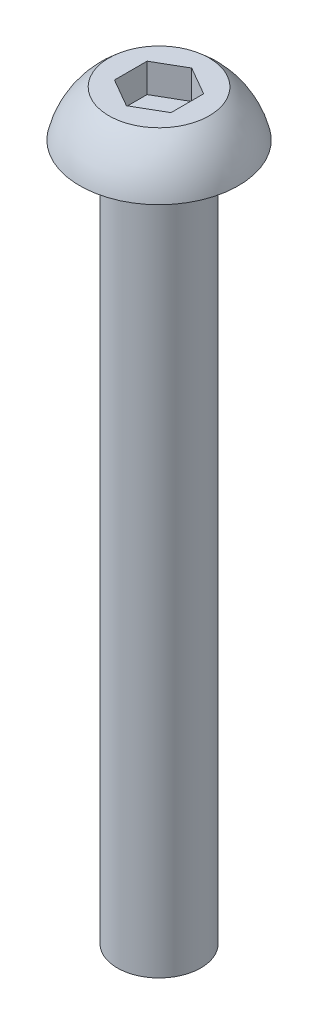
ISO-10303-21;
HEADER;
FILE_DESCRIPTION(('STEP AP214'),'2;1');
FILE_NAME('part.step','',(''),(''),'','','');
FILE_SCHEMA(('AUTOMOTIVE_DESIGN { 1 0 10303 214 1 1 1 1 }'));
ENDSEC;
DATA;
#1=APPLICATION_CONTEXT('core data for automotive mechanical design processes');
#2=APPLICATION_PROTOCOL_DEFINITION('international standard','automotive_design',2000,#1);
#3=PRODUCT_CONTEXT('',#1,'mechanical');
#4=PRODUCT('Part','Part','',(#3));
#5=PRODUCT_RELATED_PRODUCT_CATEGORY('part','',(#4));
#6=PRODUCT_DEFINITION_FORMATION('','',#4);
#7=PRODUCT_DEFINITION_CONTEXT('part definition',#1,'design');
#8=PRODUCT_DEFINITION('design','',#6,#7);
#9=PRODUCT_DEFINITION_SHAPE('','',#8);
#10=(LENGTH_UNIT() NAMED_UNIT(*) SI_UNIT(.MILLI.,.METRE.));
#11=(NAMED_UNIT(*) PLANE_ANGLE_UNIT() SI_UNIT($,.RADIAN.));
#12=(NAMED_UNIT(*) SI_UNIT($,.STERADIAN.) SOLID_ANGLE_UNIT());
#13=UNCERTAINTY_MEASURE_WITH_UNIT(LENGTH_MEASURE(1.E-05),#10,'distance_accuracy_value','');
#14=(GEOMETRIC_REPRESENTATION_CONTEXT(3) GLOBAL_UNCERTAINTY_ASSIGNED_CONTEXT((#13)) GLOBAL_UNIT_ASSIGNED_CONTEXT((#10,
#11,#12)) REPRESENTATION_CONTEXT('',''));
#15=CARTESIAN_POINT('',(0.,0.,0.));
#16=DIRECTION('',(0.,0.,1.));
#17=DIRECTION('',(1.,0.,0.));
#18=AXIS2_PLACEMENT_3D('',#15,#16,#17);
#19=CARTESIAN_POINT('',(0.,0.,0.));
#20=DIRECTION('',(0.,-1.,0.));
#21=DIRECTION('',(-1.,0.,0.));
#22=AXIS2_PLACEMENT_3D('',#19,#20,#21);
#23=SPHERICAL_SURFACE('',#22,2.92419728336959);
#24=CARTESIAN_POINT('',(0.,0.654545454545435,0.));
#25=DIRECTION('',(0.,-1.,0.));
#26=DIRECTION('',(0.,0.,-1.));
#27=AXIS2_PLACEMENT_3D('',#24,#25,#26);
#28=CIRCLE('',#27,2.85);
#29=CARTESIAN_POINT('',(0.,0.654545454545435,-2.85));
#30=VERTEX_POINT('',#29);
#31=EDGE_CURVE('E149',#30,#30,#28,.T.);
#32=ORIENTED_EDGE('',*,*,#31,.F.);
#33=EDGE_LOOP('',(#32));
#34=FACE_BOUND('',#33,.T.);
#35=CARTESIAN_POINT('',(0.,2.30454545454545,0.));
#36=DIRECTION('',(0.,-1.,0.));
#37=DIRECTION('',(0.,0.,-1.));
#38=AXIS2_PLACEMENT_3D('',#35,#36,#37);
#39=CIRCLE('',#38,1.8);
#40=CARTESIAN_POINT('',(0.,2.30454545454545,-1.8));
#41=VERTEX_POINT('',#40);
#42=EDGE_CURVE('E138',#41,#41,#39,.T.);
#43=ORIENTED_EDGE('',*,*,#42,.T.);
#44=EDGE_LOOP('',(#43));
#45=FACE_BOUND('',#44,.T.);
#46=ADVANCED_FACE('F36',(#34,#45),#23,.T.);
#47=CARTESIAN_POINT('',(-2.85,0.654545454545435,0.));
#48=DIRECTION('',(0.,1.,0.));
#49=DIRECTION('',(0.,0.,1.));
#50=AXIS2_PLACEMENT_3D('',#47,#48,#49);
#51=PLANE('',#50);
#52=CARTESIAN_POINT('',(0.,0.654545454545435,0.));
#53=DIRECTION('',(0.,1.,0.));
#54=DIRECTION('',(0.,0.,1.));
#55=AXIS2_PLACEMENT_3D('',#52,#53,#54);
#56=CIRCLE('',#55,1.6);
#57=CARTESIAN_POINT('',(0.,0.654545454545435,1.6));
#58=VERTEX_POINT('',#57);
#59=EDGE_CURVE('E11',#58,#58,#56,.T.);
#60=ORIENTED_EDGE('',*,*,#59,.T.);
#61=EDGE_LOOP('',(#60));
#62=FACE_BOUND('',#61,.T.);
#63=ORIENTED_EDGE('',*,*,#31,.T.);
#64=EDGE_LOOP('',(#63));
#65=FACE_BOUND('',#64,.T.);
#66=ADVANCED_FACE('F166',(#62,#65),#51,.F.);
#67=CARTESIAN_POINT('',(0.,0.,0.));
#68=DIRECTION('',(0.,-1.,0.));
#69=DIRECTION('',(0.,0.,-1.));
#70=AXIS2_PLACEMENT_3D('',#67,#68,#69);
#71=CYLINDRICAL_SURFACE('',#70,1.5);
#72=CARTESIAN_POINT('',(0.,0.554545454545435,0.));
#73=DIRECTION('',(0.,1.,0.));
#74=DIRECTION('',(0.,0.,1.));
#75=AXIS2_PLACEMENT_3D('',#72,#73,#74);
#76=CIRCLE('',#75,1.5);
#77=CARTESIAN_POINT('',(0.,0.554545454545435,1.5));
#78=VERTEX_POINT('',#77);
#79=EDGE_CURVE('E44',#78,#78,#76,.F.);
#80=ORIENTED_EDGE('',*,*,#79,.T.);
#81=EDGE_LOOP('',(#80));
#82=FACE_BOUND('',#81,.T.);
#83=CARTESIAN_POINT('',(0.,-24.3454545454546,0.));
#84=DIRECTION('',(0.,-1.,0.));
#85=DIRECTION('',(0.,0.,-1.));
#86=AXIS2_PLACEMENT_3D('',#83,#84,#85);
#87=CIRCLE('',#86,1.5);
#88=CARTESIAN_POINT('',(0.,-24.3454545454546,-1.5));
#89=VERTEX_POINT('',#88);
#90=EDGE_CURVE('E146',#89,#89,#87,.T.);
#91=ORIENTED_EDGE('',*,*,#90,.F.);
#92=EDGE_LOOP('',(#91));
#93=FACE_BOUND('',#92,.T.);
#94=ADVANCED_FACE('F154',(#82,#93),#71,.T.);
#95=CARTESIAN_POINT('',(0.,-24.3454545454546,0.));
#96=DIRECTION('',(0.,1.,0.));
#97=DIRECTION('',(0.,0.,1.));
#98=AXIS2_PLACEMENT_3D('',#95,#96,#97);
#99=PLANE('',#98);
#100=ORIENTED_EDGE('',*,*,#90,.T.);
#101=EDGE_LOOP('',(#100));
#102=FACE_BOUND('',#101,.T.);
#103=ADVANCED_FACE('F178',(#102),#99,.F.);
#104=CARTESIAN_POINT('',(0.,2.30454545454545,0.));
#105=DIRECTION('',(0.,-1.,0.));
#106=DIRECTION('',(0.,0.,-1.));
#107=AXIS2_PLACEMENT_3D('',#104,#105,#106);
#108=PLANE('',#107);
#109=DIRECTION('',(0.866025403784439,0.,-0.499999999999999));
#110=VECTOR('',#109,1.);
#111=CARTESIAN_POINT('',(0.,2.30454545454545,1.17202104645494));
#112=LINE('',#111,#110);
#113=CARTESIAN_POINT('',(0.,2.30454545454545,1.17202104645494));
#114=VERTEX_POINT('',#113);
#115=CARTESIAN_POINT('',(1.015,2.30454545454545,0.58601052322747));
#116=VERTEX_POINT('',#115);
#117=EDGE_CURVE('E125',#114,#116,#112,.T.);
#118=ORIENTED_EDGE('',*,*,#117,.F.);
#119=DIRECTION('',(0.866025403784439,0.,0.5));
#120=VECTOR('',#119,1.);
#121=CARTESIAN_POINT('',(-1.015,2.30454545454545,0.58601052322747));
#122=LINE('',#121,#120);
#123=CARTESIAN_POINT('',(-1.015,2.30454545454545,0.58601052322747));
#124=VERTEX_POINT('',#123);
#125=EDGE_CURVE('E51',#124,#114,#122,.T.);
#126=ORIENTED_EDGE('',*,*,#125,.F.);
#127=DIRECTION('',(0.,0.,1.));
#128=VECTOR('',#127,1.);
#129=CARTESIAN_POINT('',(-1.015,2.30454545454545,-0.586010523227472));
#130=LINE('',#129,#128);
#131=CARTESIAN_POINT('',(-1.015,2.30454545454545,-0.586010523227472));
#132=VERTEX_POINT('',#131);
#133=EDGE_CURVE('E134',#132,#124,#130,.T.);
#134=ORIENTED_EDGE('',*,*,#133,.F.);
#135=DIRECTION('',(-0.866025403784439,0.,0.499999999999999));
#136=VECTOR('',#135,1.);
#137=CARTESIAN_POINT('',(0.,2.30454545454545,-1.17202104645494));
#138=LINE('',#137,#136);
#139=CARTESIAN_POINT('',(0.,2.30454545454545,-1.17202104645494));
#140=VERTEX_POINT('',#139);
#141=EDGE_CURVE('E132',#140,#132,#138,.T.);
#142=ORIENTED_EDGE('',*,*,#141,.F.);
#143=DIRECTION('',(-0.866025403784439,0.,-0.5));
#144=VECTOR('',#143,1.);
#145=CARTESIAN_POINT('',(1.015,2.30454545454545,-0.586010523227475));
#146=LINE('',#145,#144);
#147=CARTESIAN_POINT('',(1.015,2.30454545454545,-0.586010523227475));
#148=VERTEX_POINT('',#147);
#149=EDGE_CURVE('E99',#148,#140,#146,.T.);
#150=ORIENTED_EDGE('',*,*,#149,.F.);
#151=DIRECTION('',(0.,0.,-1.));
#152=VECTOR('',#151,1.);
#153=CARTESIAN_POINT('',(1.015,2.30454545454545,0.58601052322747));
#154=LINE('',#153,#152);
#155=EDGE_CURVE('E128',#116,#148,#154,.T.);
#156=ORIENTED_EDGE('',*,*,#155,.F.);
#157=EDGE_LOOP('',(#118,#126,#134,#142,#150,#156));
#158=FACE_BOUND('',#157,.T.);
#159=ORIENTED_EDGE('',*,*,#42,.F.);
#160=EDGE_LOOP('',(#159));
#161=FACE_BOUND('',#160,.T.);
#162=ADVANCED_FACE('F181',(#158,#161),#108,.F.);
#163=CARTESIAN_POINT('',(-1.015,1.26454545454545,0.58601052322747));
#164=DIRECTION('',(-0.5,0.,0.866025403784439));
#165=DIRECTION('',(0.866025403784439,0.,0.5));
#166=AXIS2_PLACEMENT_3D('',#163,#164,#165);
#167=PLANE('',#166);
#168=ORIENTED_EDGE('',*,*,#125,.T.);
#169=DIRECTION('',(0.,1.,0.));
#170=VECTOR('',#169,1.);
#171=CARTESIAN_POINT('',(0.,1.26454545454545,1.17202104645494));
#172=LINE('',#171,#170);
#173=CARTESIAN_POINT('',(0.,1.26454545454545,1.17202104645494));
#174=VERTEX_POINT('',#173);
#175=EDGE_CURVE('E81',#174,#114,#172,.T.);
#176=ORIENTED_EDGE('',*,*,#175,.F.);
#177=DIRECTION('',(0.866025403784439,0.,0.5));
#178=VECTOR('',#177,1.);
#179=CARTESIAN_POINT('',(-1.015,1.26454545454545,0.58601052322747));
#180=LINE('',#179,#178);
#181=CARTESIAN_POINT('',(-1.015,1.26454545454545,0.58601052322747));
#182=VERTEX_POINT('',#181);
#183=EDGE_CURVE('E136',#182,#174,#180,.T.);
#184=ORIENTED_EDGE('',*,*,#183,.F.);
#185=DIRECTION('',(0.,1.,0.));
#186=VECTOR('',#185,1.);
#187=CARTESIAN_POINT('',(-1.015,1.26454545454545,0.58601052322747));
#188=LINE('',#187,#186);
#189=EDGE_CURVE('E59',#182,#124,#188,.T.);
#190=ORIENTED_EDGE('',*,*,#189,.T.);
#191=EDGE_LOOP('',(#168,#176,#184,#190));
#192=FACE_BOUND('',#191,.T.);
#193=ADVANCED_FACE('F185',(#192),#167,.F.);
#194=CARTESIAN_POINT('',(-1.015,1.26454545454545,-0.586010523227472));
#195=DIRECTION('',(-1.,0.,0.));
#196=DIRECTION('',(0.,0.,1.));
#197=AXIS2_PLACEMENT_3D('',#194,#195,#196);
#198=PLANE('',#197);
#199=ORIENTED_EDGE('',*,*,#133,.T.);
#200=ORIENTED_EDGE('',*,*,#189,.F.);
#201=DIRECTION('',(0.,0.,1.));
#202=VECTOR('',#201,1.);
#203=CARTESIAN_POINT('',(-1.015,1.26454545454545,-0.586010523227472));
#204=LINE('',#203,#202);
#205=CARTESIAN_POINT('',(-1.015,1.26454545454545,-0.586010523227472));
#206=VERTEX_POINT('',#205);
#207=EDGE_CURVE('E111',#206,#182,#204,.T.);
#208=ORIENTED_EDGE('',*,*,#207,.F.);
#209=DIRECTION('',(0.,1.,0.));
#210=VECTOR('',#209,1.);
#211=CARTESIAN_POINT('',(-1.015,1.26454545454545,-0.586010523227472));
#212=LINE('',#211,#210);
#213=EDGE_CURVE('E103',#206,#132,#212,.T.);
#214=ORIENTED_EDGE('',*,*,#213,.T.);
#215=EDGE_LOOP('',(#199,#200,#208,#214));
#216=FACE_BOUND('',#215,.T.);
#217=ADVANCED_FACE('F189',(#216),#198,.F.);
#218=CARTESIAN_POINT('',(0.,1.26454545454545,-1.17202104645494));
#219=DIRECTION('',(-0.499999999999999,0.,-0.866025403784439));
#220=DIRECTION('',(-0.866025403784439,0.,0.5));
#221=AXIS2_PLACEMENT_3D('',#218,#219,#220);
#222=PLANE('',#221);
#223=ORIENTED_EDGE('',*,*,#141,.T.);
#224=ORIENTED_EDGE('',*,*,#213,.F.);
#225=DIRECTION('',(-0.866025403784439,0.,0.499999999999999));
#226=VECTOR('',#225,1.);
#227=CARTESIAN_POINT('',(0.,1.26454545454545,-1.17202104645494));
#228=LINE('',#227,#226);
#229=CARTESIAN_POINT('',(0.,1.26454545454545,-1.17202104645494));
#230=VERTEX_POINT('',#229);
#231=EDGE_CURVE('E107',#230,#206,#228,.T.);
#232=ORIENTED_EDGE('',*,*,#231,.F.);
#233=DIRECTION('',(0.,1.,0.));
#234=VECTOR('',#233,1.);
#235=CARTESIAN_POINT('',(0.,1.26454545454545,-1.17202104645494));
#236=LINE('',#235,#234);
#237=EDGE_CURVE('E92',#230,#140,#236,.T.);
#238=ORIENTED_EDGE('',*,*,#237,.T.);
#239=EDGE_LOOP('',(#223,#224,#232,#238));
#240=FACE_BOUND('',#239,.T.);
#241=ADVANCED_FACE('F108',(#240),#222,.F.);
#242=CARTESIAN_POINT('',(1.015,1.26454545454545,-0.586010523227475));
#243=DIRECTION('',(0.5,0.,-0.866025403784439));
#244=DIRECTION('',(-0.866025403784439,0.,-0.5));
#245=AXIS2_PLACEMENT_3D('',#242,#243,#244);
#246=PLANE('',#245);
#247=ORIENTED_EDGE('',*,*,#149,.T.);
#248=ORIENTED_EDGE('',*,*,#237,.F.);
#249=DIRECTION('',(-0.866025403784439,0.,-0.5));
#250=VECTOR('',#249,1.);
#251=CARTESIAN_POINT('',(1.015,1.26454545454545,-0.586010523227475));
#252=LINE('',#251,#250);
#253=CARTESIAN_POINT('',(1.015,1.26454545454545,-0.586010523227475));
#254=VERTEX_POINT('',#253);
#255=EDGE_CURVE('E96',#254,#230,#252,.T.);
#256=ORIENTED_EDGE('',*,*,#255,.F.);
#257=DIRECTION('',(0.,1.,0.));
#258=VECTOR('',#257,1.);
#259=CARTESIAN_POINT('',(1.015,1.26454545454545,-0.586010523227475));
#260=LINE('',#259,#258);
#261=EDGE_CURVE('E104',#254,#148,#260,.T.);
#262=ORIENTED_EDGE('',*,*,#261,.T.);
#263=EDGE_LOOP('',(#247,#248,#256,#262));
#264=FACE_BOUND('',#263,.T.);
#265=ADVANCED_FACE('F94',(#264),#246,.F.);
#266=CARTESIAN_POINT('',(1.015,1.26454545454545,0.58601052322747));
#267=DIRECTION('',(1.,0.,0.));
#268=DIRECTION('',(0.,0.,-1.));
#269=AXIS2_PLACEMENT_3D('',#266,#267,#268);
#270=PLANE('',#269);
#271=ORIENTED_EDGE('',*,*,#155,.T.);
#272=ORIENTED_EDGE('',*,*,#261,.F.);
#273=DIRECTION('',(0.,0.,-1.));
#274=VECTOR('',#273,1.);
#275=CARTESIAN_POINT('',(1.015,1.26454545454545,0.58601052322747));
#276=LINE('',#275,#274);
#277=CARTESIAN_POINT('',(1.015,1.26454545454545,0.58601052322747));
#278=VERTEX_POINT('',#277);
#279=EDGE_CURVE('E117',#278,#254,#276,.T.);
#280=ORIENTED_EDGE('',*,*,#279,.F.);
#281=DIRECTION('',(0.,1.,0.));
#282=VECTOR('',#281,1.);
#283=CARTESIAN_POINT('',(1.015,1.26454545454545,0.58601052322747));
#284=LINE('',#283,#282);
#285=EDGE_CURVE('E141',#278,#116,#284,.T.);
#286=ORIENTED_EDGE('',*,*,#285,.T.);
#287=EDGE_LOOP('',(#271,#272,#280,#286));
#288=FACE_BOUND('',#287,.T.);
#289=ADVANCED_FACE('F192',(#288),#270,.F.);
#290=CARTESIAN_POINT('',(0.,1.26454545454545,1.17202104645494));
#291=DIRECTION('',(0.499999999999999,0.,0.866025403784439));
#292=DIRECTION('',(0.866025403784439,0.,-0.5));
#293=AXIS2_PLACEMENT_3D('',#290,#291,#292);
#294=PLANE('',#293);
#295=ORIENTED_EDGE('',*,*,#117,.T.);
#296=ORIENTED_EDGE('',*,*,#285,.F.);
#297=DIRECTION('',(0.866025403784439,0.,-0.499999999999999));
#298=VECTOR('',#297,1.);
#299=CARTESIAN_POINT('',(0.,1.26454545454545,1.17202104645494));
#300=LINE('',#299,#298);
#301=EDGE_CURVE('E119',#174,#278,#300,.T.);
#302=ORIENTED_EDGE('',*,*,#301,.F.);
#303=ORIENTED_EDGE('',*,*,#175,.T.);
#304=EDGE_LOOP('',(#295,#296,#302,#303));
#305=FACE_BOUND('',#304,.T.);
#306=ADVANCED_FACE('F162',(#305),#294,.F.);
#307=CARTESIAN_POINT('',(0.,1.26454545454545,0.));
#308=DIRECTION('',(0.,1.,0.));
#309=DIRECTION('',(0.,0.,1.));
#310=AXIS2_PLACEMENT_3D('',#307,#308,#309);
#311=PLANE('',#310);
#312=ORIENTED_EDGE('',*,*,#183,.T.);
#313=ORIENTED_EDGE('',*,*,#301,.T.);
#314=ORIENTED_EDGE('',*,*,#279,.T.);
#315=ORIENTED_EDGE('',*,*,#255,.T.);
#316=ORIENTED_EDGE('',*,*,#231,.T.);
#317=ORIENTED_EDGE('',*,*,#207,.T.);
#318=EDGE_LOOP('',(#312,#313,#314,#315,#316,#317));
#319=FACE_BOUND('',#318,.T.);
#320=ADVANCED_FACE('F114',(#319),#311,.T.);
#321=CARTESIAN_POINT('',(0.,0.554545454545435,0.));
#322=DIRECTION('',(0.,1.,0.));
#323=DIRECTION('',(0.,0.,1.));
#324=AXIS2_PLACEMENT_3D('',#321,#322,#323);
#325=TOROIDAL_SURFACE('',#324,1.6,0.1);
#326=ORIENTED_EDGE('',*,*,#59,.F.);
#327=EDGE_LOOP('',(#326));
#328=FACE_BOUND('',#327,.T.);
#329=ORIENTED_EDGE('',*,*,#79,.F.);
#330=EDGE_LOOP('',(#329));
#331=FACE_BOUND('',#330,.T.);
#332=ADVANCED_FACE('F38',(#328,#331),#325,.F.);
#333=CLOSED_SHELL('',(#46,#66,#94,#103,#162,#193,#217,#241,#265,#289,#306,#320,#332));
#334=MANIFOLD_SOLID_BREP('B2',#333);
#335=ADVANCED_BREP_SHAPE_REPRESENTATION('',(#18,#334),#14);
#336=SHAPE_DEFINITION_REPRESENTATION(#9,#335);
ENDSEC;
END-ISO-10303-21;
